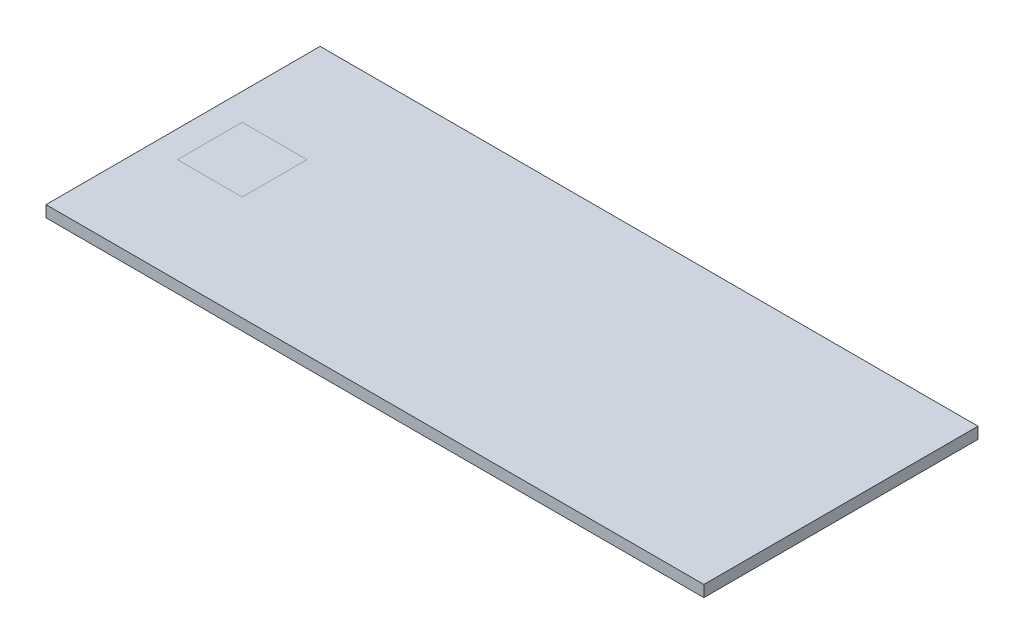
ISO-10303-21;
HEADER;
FILE_DESCRIPTION(('STEP AP214'),'2;1');
FILE_NAME('part.step','',(''),(''),'','','');
FILE_SCHEMA(('AUTOMOTIVE_DESIGN { 1 0 10303 214 1 1 1 1 }'));
ENDSEC;
DATA;
#1=APPLICATION_CONTEXT('core data for automotive mechanical design processes');
#2=APPLICATION_PROTOCOL_DEFINITION('international standard','automotive_design',2000,#1);
#3=PRODUCT_CONTEXT('',#1,'mechanical');
#4=PRODUCT('Part','Part','',(#3));
#5=PRODUCT_RELATED_PRODUCT_CATEGORY('part','',(#4));
#6=PRODUCT_DEFINITION_FORMATION('','',#4);
#7=PRODUCT_DEFINITION_CONTEXT('part definition',#1,'design');
#8=PRODUCT_DEFINITION('design','',#6,#7);
#9=PRODUCT_DEFINITION_SHAPE('','',#8);
#10=(LENGTH_UNIT() NAMED_UNIT(*) SI_UNIT(.MILLI.,.METRE.));
#11=(NAMED_UNIT(*) PLANE_ANGLE_UNIT() SI_UNIT($,.RADIAN.));
#12=(NAMED_UNIT(*) SI_UNIT($,.STERADIAN.) SOLID_ANGLE_UNIT());
#13=UNCERTAINTY_MEASURE_WITH_UNIT(LENGTH_MEASURE(1.E-05),#10,'distance_accuracy_value','');
#14=(GEOMETRIC_REPRESENTATION_CONTEXT(3) GLOBAL_UNCERTAINTY_ASSIGNED_CONTEXT((#13)) GLOBAL_UNIT_ASSIGNED_CONTEXT((#10,
#11,#12)) REPRESENTATION_CONTEXT('',''));
#15=CARTESIAN_POINT('',(0.,0.,0.));
#16=DIRECTION('',(0.,0.,1.));
#17=DIRECTION('',(1.,0.,0.));
#18=AXIS2_PLACEMENT_3D('',#15,#16,#17);
#19=CARTESIAN_POINT('',(914.4,-2.66453525910038E-12,381.));
#20=DIRECTION('',(0.,-1.,0.));
#21=DIRECTION('',(0.,0.,-1.));
#22=AXIS2_PLACEMENT_3D('',#19,#20,#21);
#23=PLANE('',#22);
#24=DIRECTION('',(-1.,0.,0.));
#25=VECTOR('',#24,1.);
#26=CARTESIAN_POINT('',(914.4,0.,-381.));
#27=LINE('',#26,#25);
#28=CARTESIAN_POINT('',(914.4,0.,-381.));
#29=VERTEX_POINT('',#28);
#30=CARTESIAN_POINT('',(-914.4,0.,-381.));
#31=VERTEX_POINT('',#30);
#32=EDGE_CURVE('E184',#29,#31,#27,.T.);
#33=ORIENTED_EDGE('',*,*,#32,.T.);
#34=DIRECTION('',(0.,0.,1.));
#35=VECTOR('',#34,1.);
#36=CARTESIAN_POINT('',(-914.4,-2.66453525910038E-12,381.));
#37=LINE('',#36,#35);
#38=CARTESIAN_POINT('',(-914.4,-2.66453525910038E-12,381.));
#39=VERTEX_POINT('',#38);
#40=EDGE_CURVE('E311',#31,#39,#37,.T.);
#41=ORIENTED_EDGE('',*,*,#40,.T.);
#42=DIRECTION('',(-1.,0.,0.));
#43=VECTOR('',#42,1.);
#44=CARTESIAN_POINT('',(914.4,-2.66453525910038E-12,381.));
#45=LINE('',#44,#43);
#46=CARTESIAN_POINT('',(914.4,-2.66453525910038E-12,381.));
#47=VERTEX_POINT('',#46);
#48=EDGE_CURVE('E177',#47,#39,#45,.T.);
#49=ORIENTED_EDGE('',*,*,#48,.F.);
#50=DIRECTION('',(0.,0.,1.));
#51=VECTOR('',#50,1.);
#52=CARTESIAN_POINT('',(914.4,-2.66453525910038E-12,381.));
#53=LINE('',#52,#51);
#54=EDGE_CURVE('E305',#29,#47,#53,.T.);
#55=ORIENTED_EDGE('',*,*,#54,.F.);
#56=EDGE_LOOP('',(#33,#41,#49,#55));
#57=FACE_BOUND('',#56,.T.);
#58=DIRECTION('',(0.,0.,-1.));
#59=VECTOR('',#58,1.);
#60=CARTESIAN_POINT('',(-660.,-2.66453525910038E-12,381.));
#61=LINE('',#60,#59);
#62=CARTESIAN_POINT('',(-660.,-1.64697651842031E-12,90.));
#63=VERTEX_POINT('',#62);
#64=CARTESIAN_POINT('',(-660.,-1.01755874068006E-12,-90.));
#65=VERTEX_POINT('',#64);
#66=EDGE_CURVE('E12',#63,#65,#61,.T.);
#67=ORIENTED_EDGE('',*,*,#66,.F.);
#68=DIRECTION('',(1.,0.,0.));
#69=VECTOR('',#68,1.);
#70=CARTESIAN_POINT('',(914.4,-1.64697651842031E-12,90.));
#71=LINE('',#70,#69);
#72=CARTESIAN_POINT('',(-840.,-1.64697651842031E-12,90.));
#73=VERTEX_POINT('',#72);
#74=EDGE_CURVE('E200',#73,#63,#71,.T.);
#75=ORIENTED_EDGE('',*,*,#74,.F.);
#76=DIRECTION('',(0.,0.,1.));
#77=VECTOR('',#76,1.);
#78=CARTESIAN_POINT('',(-840.,-2.66453525910038E-12,381.));
#79=LINE('',#78,#77);
#80=CARTESIAN_POINT('',(-840.,-1.01755874068006E-12,-90.0000000000001));
#81=VERTEX_POINT('',#80);
#82=EDGE_CURVE('E204',#81,#73,#79,.T.);
#83=ORIENTED_EDGE('',*,*,#82,.F.);
#84=DIRECTION('',(-1.,0.,0.));
#85=VECTOR('',#84,1.);
#86=CARTESIAN_POINT('',(914.4,-1.01755874068006E-12,-90.));
#87=LINE('',#86,#85);
#88=EDGE_CURVE('E63',#65,#81,#87,.T.);
#89=ORIENTED_EDGE('',*,*,#88,.F.);
#90=EDGE_LOOP('',(#67,#75,#83,#89));
#91=FACE_BOUND('',#90,.T.);
#92=ADVANCED_FACE('F53',(#57,#91),#23,.F.);
#93=CARTESIAN_POINT('',(914.4,-4.57200000000266,376.428));
#94=DIRECTION('',(0.,0.,1.));
#95=DIRECTION('',(1.,0.,0.));
#96=AXIS2_PLACEMENT_3D('',#93,#94,#95);
#97=PLANE('',#96);
#98=DIRECTION('',(0.,1.,0.));
#99=VECTOR('',#98,1.);
#100=CARTESIAN_POINT('',(909.828,-4.5720000000027,376.428));
#101=LINE('',#100,#99);
#102=CARTESIAN_POINT('',(909.828,-27.1779999999964,376.428));
#103=VERTEX_POINT('',#102);
#104=CARTESIAN_POINT('',(909.828,-4.57200000000266,376.428));
#105=VERTEX_POINT('',#104);
#106=EDGE_CURVE('E274',#103,#105,#101,.T.);
#107=ORIENTED_EDGE('',*,*,#106,.F.);
#108=DIRECTION('',(-1.,0.,0.));
#109=VECTOR('',#108,1.);
#110=CARTESIAN_POINT('',(914.4,-27.1780000000027,376.428));
#111=LINE('',#110,#109);
#112=CARTESIAN_POINT('',(-909.828,-27.1780000000027,376.428));
#113=VERTEX_POINT('',#112);
#114=EDGE_CURVE('E179',#103,#113,#111,.T.);
#115=ORIENTED_EDGE('',*,*,#114,.T.);
#116=DIRECTION('',(0.,-1.,0.));
#117=VECTOR('',#116,1.);
#118=CARTESIAN_POINT('',(-909.828,-4.57200000000266,376.428));
#119=LINE('',#118,#117);
#120=CARTESIAN_POINT('',(-909.828,-4.57200000000266,376.428));
#121=VERTEX_POINT('',#120);
#122=EDGE_CURVE('E280',#121,#113,#119,.T.);
#123=ORIENTED_EDGE('',*,*,#122,.F.);
#124=DIRECTION('',(-1.,0.,0.));
#125=VECTOR('',#124,1.);
#126=CARTESIAN_POINT('',(914.4,-4.57200000000266,376.428));
#127=LINE('',#126,#125);
#128=EDGE_CURVE('E196',#105,#121,#127,.T.);
#129=ORIENTED_EDGE('',*,*,#128,.F.);
#130=EDGE_LOOP('',(#107,#115,#123,#129));
#131=FACE_BOUND('',#130,.T.);
#132=ADVANCED_FACE('F55',(#131),#97,.F.);
#133=CARTESIAN_POINT('',(914.4,-4.57200000000266,376.428));
#134=DIRECTION('',(0.,1.,0.));
#135=DIRECTION('',(0.,0.,1.));
#136=AXIS2_PLACEMENT_3D('',#133,#134,#135);
#137=PLANE('',#136);
#138=DIRECTION('',(0.,0.,-1.));
#139=VECTOR('',#138,1.);
#140=CARTESIAN_POINT('',(909.828,-4.57200000000266,376.428));
#141=LINE('',#140,#139);
#142=CARTESIAN_POINT('',(909.828,-4.57200000000266,-376.428));
#143=VERTEX_POINT('',#142);
#144=EDGE_CURVE('E267',#105,#143,#141,.T.);
#145=ORIENTED_EDGE('',*,*,#144,.F.);
#146=ORIENTED_EDGE('',*,*,#128,.T.);
#147=DIRECTION('',(0.,0.,1.));
#148=VECTOR('',#147,1.);
#149=CARTESIAN_POINT('',(-909.828,-4.57200000000266,376.428));
#150=LINE('',#149,#148);
#151=CARTESIAN_POINT('',(-909.828,-4.57200000000266,-376.428));
#152=VERTEX_POINT('',#151);
#153=EDGE_CURVE('E285',#152,#121,#150,.T.);
#154=ORIENTED_EDGE('',*,*,#153,.F.);
#155=DIRECTION('',(-1.,0.,0.));
#156=VECTOR('',#155,1.);
#157=CARTESIAN_POINT('',(914.4,-4.57200000000266,-376.428));
#158=LINE('',#157,#156);
#159=EDGE_CURVE('E194',#143,#152,#158,.T.);
#160=ORIENTED_EDGE('',*,*,#159,.F.);
#161=EDGE_LOOP('',(#145,#146,#154,#160));
#162=FACE_BOUND('',#161,.T.);
#163=ADVANCED_FACE('F234',(#162),#137,.F.);
#164=CARTESIAN_POINT('',(914.4,-4.57200000000266,-376.428));
#165=DIRECTION('',(0.,0.,-1.));
#166=DIRECTION('',(-1.,0.,0.));
#167=AXIS2_PLACEMENT_3D('',#164,#165,#166);
#168=PLANE('',#167);
#169=DIRECTION('',(0.,-1.,0.));
#170=VECTOR('',#169,1.);
#171=CARTESIAN_POINT('',(909.828,-4.5720000000027,-376.428));
#172=LINE('',#171,#170);
#173=CARTESIAN_POINT('',(909.828,-27.1779999999964,-376.428));
#174=VERTEX_POINT('',#173);
#175=EDGE_CURVE('E275',#143,#174,#172,.T.);
#176=ORIENTED_EDGE('',*,*,#175,.F.);
#177=ORIENTED_EDGE('',*,*,#159,.T.);
#178=DIRECTION('',(0.,1.,0.));
#179=VECTOR('',#178,1.);
#180=CARTESIAN_POINT('',(-909.828,-4.57200000000266,-376.428));
#181=LINE('',#180,#179);
#182=CARTESIAN_POINT('',(-909.828,-27.178,-376.428));
#183=VERTEX_POINT('',#182);
#184=EDGE_CURVE('E290',#183,#152,#181,.T.);
#185=ORIENTED_EDGE('',*,*,#184,.F.);
#186=DIRECTION('',(-1.,0.,0.));
#187=VECTOR('',#186,1.);
#188=CARTESIAN_POINT('',(914.4,-27.178,-376.428));
#189=LINE('',#188,#187);
#190=EDGE_CURVE('E192',#174,#183,#189,.T.);
#191=ORIENTED_EDGE('',*,*,#190,.F.);
#192=EDGE_LOOP('',(#176,#177,#185,#191));
#193=FACE_BOUND('',#192,.T.);
#194=ADVANCED_FACE('F257',(#193),#168,.F.);
#195=CARTESIAN_POINT('',(914.4,-27.178,-349.25));
#196=DIRECTION('',(0.,0.,-1.));
#197=DIRECTION('',(-1.,0.,0.));
#198=AXIS2_PLACEMENT_3D('',#195,#196,#197);
#199=PLANE('',#198);
#200=DIRECTION('',(0.,-1.,0.));
#201=VECTOR('',#200,1.);
#202=CARTESIAN_POINT('',(882.65,-27.178,-349.25));
#203=LINE('',#202,#201);
#204=CARTESIAN_POINT('',(882.65,-27.1779999999966,-349.25));
#205=VERTEX_POINT('',#204);
#206=CARTESIAN_POINT('',(882.65,-31.7499999999967,-349.25));
#207=VERTEX_POINT('',#206);
#208=EDGE_CURVE('E156',#205,#207,#203,.T.);
#209=ORIENTED_EDGE('',*,*,#208,.F.);
#210=DIRECTION('',(-1.,0.,0.));
#211=VECTOR('',#210,1.);
#212=CARTESIAN_POINT('',(914.4,-27.178,-349.25));
#213=LINE('',#212,#211);
#214=CARTESIAN_POINT('',(-882.65,-27.178,-349.25));
#215=VERTEX_POINT('',#214);
#216=EDGE_CURVE('E190',#205,#215,#213,.T.);
#217=ORIENTED_EDGE('',*,*,#216,.T.);
#218=DIRECTION('',(0.,1.,0.));
#219=VECTOR('',#218,1.);
#220=CARTESIAN_POINT('',(-882.65,-27.178,-349.25));
#221=LINE('',#220,#219);
#222=CARTESIAN_POINT('',(-882.65,-31.75,-349.25));
#223=VERTEX_POINT('',#222);
#224=EDGE_CURVE('E296',#223,#215,#221,.T.);
#225=ORIENTED_EDGE('',*,*,#224,.F.);
#226=DIRECTION('',(-1.,0.,0.));
#227=VECTOR('',#226,1.);
#228=CARTESIAN_POINT('',(914.4,-31.75,-349.25));
#229=LINE('',#228,#227);
#230=EDGE_CURVE('E188',#207,#223,#229,.T.);
#231=ORIENTED_EDGE('',*,*,#230,.F.);
#232=EDGE_LOOP('',(#209,#217,#225,#231));
#233=FACE_BOUND('',#232,.T.);
#234=ADVANCED_FACE('F254',(#233),#199,.F.);
#235=CARTESIAN_POINT('',(914.4,-27.1780000000027,349.25));
#236=DIRECTION('',(0.,0.,1.));
#237=DIRECTION('',(1.,0.,0.));
#238=AXIS2_PLACEMENT_3D('',#235,#236,#237);
#239=PLANE('',#238);
#240=DIRECTION('',(0.,1.,0.));
#241=VECTOR('',#240,1.);
#242=CARTESIAN_POINT('',(882.65,-27.1780000000027,349.25));
#243=LINE('',#242,#241);
#244=CARTESIAN_POINT('',(882.65,-31.7499999999967,349.25));
#245=VERTEX_POINT('',#244);
#246=CARTESIAN_POINT('',(882.65,-27.1779999999966,349.25));
#247=VERTEX_POINT('',#246);
#248=EDGE_CURVE('E153',#245,#247,#243,.T.);
#249=ORIENTED_EDGE('',*,*,#248,.F.);
#250=DIRECTION('',(-1.,0.,0.));
#251=VECTOR('',#250,1.);
#252=CARTESIAN_POINT('',(914.4,-31.7500000000022,349.25));
#253=LINE('',#252,#251);
#254=CARTESIAN_POINT('',(-882.65,-31.7500000000022,349.25));
#255=VERTEX_POINT('',#254);
#256=EDGE_CURVE('E166',#245,#255,#253,.T.);
#257=ORIENTED_EDGE('',*,*,#256,.T.);
#258=DIRECTION('',(0.,-1.,0.));
#259=VECTOR('',#258,1.);
#260=CARTESIAN_POINT('',(-882.65,-27.1780000000027,349.25));
#261=LINE('',#260,#259);
#262=CARTESIAN_POINT('',(-882.65,-27.1780000000027,349.25));
#263=VERTEX_POINT('',#262);
#264=EDGE_CURVE('E284',#263,#255,#261,.T.);
#265=ORIENTED_EDGE('',*,*,#264,.F.);
#266=DIRECTION('',(-1.,0.,0.));
#267=VECTOR('',#266,1.);
#268=CARTESIAN_POINT('',(914.4,-27.1780000000027,349.25));
#269=LINE('',#268,#267);
#270=EDGE_CURVE('E168',#247,#263,#269,.T.);
#271=ORIENTED_EDGE('',*,*,#270,.F.);
#272=EDGE_LOOP('',(#249,#257,#265,#271));
#273=FACE_BOUND('',#272,.T.);
#274=ADVANCED_FACE('F164',(#273),#239,.F.);
#275=CARTESIAN_POINT('',(914.4,-27.1780000000027,376.428));
#276=DIRECTION('',(0.,-1.,0.));
#277=DIRECTION('',(0.,0.,-1.));
#278=AXIS2_PLACEMENT_3D('',#275,#276,#277);
#279=PLANE('',#278);
#280=ORIENTED_EDGE('',*,*,#216,.F.);
#281=DIRECTION('',(0.,0.,-1.));
#282=VECTOR('',#281,1.);
#283=CARTESIAN_POINT('',(882.65,-27.1779999999966,381.));
#284=LINE('',#283,#282);
#285=EDGE_CURVE('E160',#247,#205,#284,.T.);
#286=ORIENTED_EDGE('',*,*,#285,.F.);
#287=ORIENTED_EDGE('',*,*,#270,.T.);
#288=DIRECTION('',(0.,0.,-1.));
#289=VECTOR('',#288,1.);
#290=CARTESIAN_POINT('',(-882.65,-27.1780000000026,381.));
#291=LINE('',#290,#289);
#292=EDGE_CURVE('E483',#263,#215,#291,.T.);
#293=ORIENTED_EDGE('',*,*,#292,.T.);
#294=EDGE_LOOP('',(#280,#286,#287,#293));
#295=FACE_BOUND('',#294,.T.);
#296=DIRECTION('',(0.,0.,-1.));
#297=VECTOR('',#296,1.);
#298=CARTESIAN_POINT('',(909.828,-27.1779999999964,381.));
#299=LINE('',#298,#297);
#300=EDGE_CURVE('E474',#103,#174,#299,.T.);
#301=ORIENTED_EDGE('',*,*,#300,.T.);
#302=ORIENTED_EDGE('',*,*,#190,.T.);
#303=DIRECTION('',(0.,0.,-1.));
#304=VECTOR('',#303,1.);
#305=CARTESIAN_POINT('',(-909.828,-27.1780000000027,376.428));
#306=LINE('',#305,#304);
#307=EDGE_CURVE('E198',#113,#183,#306,.T.);
#308=ORIENTED_EDGE('',*,*,#307,.F.);
#309=ORIENTED_EDGE('',*,*,#114,.F.);
#310=EDGE_LOOP('',(#301,#302,#308,#309));
#311=FACE_BOUND('',#310,.T.);
#312=ADVANCED_FACE('F245',(#295,#311),#279,.F.);
#313=CARTESIAN_POINT('',(914.4,0.,-381.));
#314=DIRECTION('',(0.,0.,1.));
#315=DIRECTION('',(0.,-1.,0.));
#316=AXIS2_PLACEMENT_3D('',#313,#314,#315);
#317=PLANE('',#316);
#318=DIRECTION('',(0.,1.,0.));
#319=VECTOR('',#318,1.);
#320=CARTESIAN_POINT('',(-914.4,0.,-381.));
#321=LINE('',#320,#319);
#322=CARTESIAN_POINT('',(-914.4,-31.75,-381.));
#323=VERTEX_POINT('',#322);
#324=EDGE_CURVE('E299',#323,#31,#321,.T.);
#325=ORIENTED_EDGE('',*,*,#324,.T.);
#326=ORIENTED_EDGE('',*,*,#32,.F.);
#327=DIRECTION('',(0.,1.,0.));
#328=VECTOR('',#327,1.);
#329=CARTESIAN_POINT('',(914.4,0.,-381.));
#330=LINE('',#329,#328);
#331=CARTESIAN_POINT('',(914.4,-31.75,-381.));
#332=VERTEX_POINT('',#331);
#333=EDGE_CURVE('E302',#332,#29,#330,.T.);
#334=ORIENTED_EDGE('',*,*,#333,.F.);
#335=DIRECTION('',(-1.,0.,0.));
#336=VECTOR('',#335,1.);
#337=CARTESIAN_POINT('',(914.4,-31.75,-381.));
#338=LINE('',#337,#336);
#339=EDGE_CURVE('E186',#332,#323,#338,.T.);
#340=ORIENTED_EDGE('',*,*,#339,.T.);
#341=EDGE_LOOP('',(#325,#326,#334,#340));
#342=FACE_BOUND('',#341,.T.);
#343=ADVANCED_FACE('F240',(#342),#317,.F.);
#344=ORIENTED_EDGE('',*,*,#74,.T.);
#345=ORIENTED_EDGE('',*,*,#66,.T.);
#346=ORIENTED_EDGE('',*,*,#88,.T.);
#347=ORIENTED_EDGE('',*,*,#82,.T.);
#348=EDGE_LOOP('',(#344,#345,#346,#347));
#349=FACE_BOUND('',#348,.T.);
#350=ADVANCED_FACE('F224',(#349),#23,.F.);
#351=CARTESIAN_POINT('',(914.4,-2.66453525910038E-12,381.));
#352=DIRECTION('',(0.,0.,-1.));
#353=DIRECTION('',(0.,1.,0.));
#354=AXIS2_PLACEMENT_3D('',#351,#352,#353);
#355=PLANE('',#354);
#356=ORIENTED_EDGE('',*,*,#48,.T.);
#357=DIRECTION('',(0.,-1.,0.));
#358=VECTOR('',#357,1.);
#359=CARTESIAN_POINT('',(-914.4,-2.66453525910038E-12,381.));
#360=LINE('',#359,#358);
#361=CARTESIAN_POINT('',(-914.4,-31.7500000000027,381.));
#362=VERTEX_POINT('',#361);
#363=EDGE_CURVE('E314',#39,#362,#360,.T.);
#364=ORIENTED_EDGE('',*,*,#363,.T.);
#365=DIRECTION('',(-1.,0.,0.));
#366=VECTOR('',#365,1.);
#367=CARTESIAN_POINT('',(914.4,-31.7500000000027,381.));
#368=LINE('',#367,#366);
#369=CARTESIAN_POINT('',(914.4,-31.7500000000027,381.));
#370=VERTEX_POINT('',#369);
#371=EDGE_CURVE('E175',#370,#362,#368,.T.);
#372=ORIENTED_EDGE('',*,*,#371,.F.);
#373=DIRECTION('',(0.,-1.,0.));
#374=VECTOR('',#373,1.);
#375=CARTESIAN_POINT('',(914.4,-2.66453525910038E-12,381.));
#376=LINE('',#375,#374);
#377=EDGE_CURVE('E307',#47,#370,#376,.T.);
#378=ORIENTED_EDGE('',*,*,#377,.F.);
#379=EDGE_LOOP('',(#356,#364,#372,#378));
#380=FACE_BOUND('',#379,.T.);
#381=ADVANCED_FACE('F239',(#380),#355,.F.);
#382=CARTESIAN_POINT('',(914.4,-31.7500000000027,381.));
#383=DIRECTION('',(0.,1.,0.));
#384=DIRECTION('',(0.,0.,1.));
#385=AXIS2_PLACEMENT_3D('',#382,#383,#384);
#386=PLANE('',#385);
#387=DIRECTION('',(0.,0.,-1.));
#388=VECTOR('',#387,1.);
#389=CARTESIAN_POINT('',(882.65,-31.7499999999967,381.));
#390=LINE('',#389,#388);
#391=EDGE_CURVE('E150',#245,#207,#390,.T.);
#392=ORIENTED_EDGE('',*,*,#391,.T.);
#393=ORIENTED_EDGE('',*,*,#230,.T.);
#394=DIRECTION('',(0.,0.,-1.));
#395=VECTOR('',#394,1.);
#396=CARTESIAN_POINT('',(-882.65,-31.7500000000027,381.));
#397=LINE('',#396,#395);
#398=EDGE_CURVE('E174',#255,#223,#397,.T.);
#399=ORIENTED_EDGE('',*,*,#398,.F.);
#400=ORIENTED_EDGE('',*,*,#256,.F.);
#401=EDGE_LOOP('',(#392,#393,#399,#400));
#402=FACE_BOUND('',#401,.T.);
#403=DIRECTION('',(0.,0.,-1.));
#404=VECTOR('',#403,1.);
#405=CARTESIAN_POINT('',(914.4,-31.75,-381.));
#406=LINE('',#405,#404);
#407=EDGE_CURVE('E300',#370,#332,#406,.T.);
#408=ORIENTED_EDGE('',*,*,#407,.F.);
#409=ORIENTED_EDGE('',*,*,#371,.T.);
#410=DIRECTION('',(0.,0.,-1.));
#411=VECTOR('',#410,1.);
#412=CARTESIAN_POINT('',(-914.4,-31.7500000000027,381.));
#413=LINE('',#412,#411);
#414=EDGE_CURVE('E303',#362,#323,#413,.T.);
#415=ORIENTED_EDGE('',*,*,#414,.T.);
#416=ORIENTED_EDGE('',*,*,#339,.F.);
#417=EDGE_LOOP('',(#408,#409,#415,#416));
#418=FACE_BOUND('',#417,.T.);
#419=ADVANCED_FACE('F171',(#402,#418),#386,.F.);
#420=CARTESIAN_POINT('',(914.4,0.,0.));
#421=DIRECTION('',(1.,0.,0.));
#422=DIRECTION('',(0.,0.,-1.));
#423=AXIS2_PLACEMENT_3D('',#420,#421,#422);
#424=PLANE('',#423);
#425=ORIENTED_EDGE('',*,*,#377,.T.);
#426=ORIENTED_EDGE('',*,*,#407,.T.);
#427=ORIENTED_EDGE('',*,*,#333,.T.);
#428=ORIENTED_EDGE('',*,*,#54,.T.);
#429=EDGE_LOOP('',(#425,#426,#427,#428));
#430=FACE_BOUND('',#429,.T.);
#431=ADVANCED_FACE('F330',(#430),#424,.T.);
#432=CARTESIAN_POINT('',(-914.4,0.,0.));
#433=DIRECTION('',(1.,0.,0.));
#434=DIRECTION('',(0.,0.,-1.));
#435=AXIS2_PLACEMENT_3D('',#432,#433,#434);
#436=PLANE('',#435);
#437=ORIENTED_EDGE('',*,*,#324,.F.);
#438=ORIENTED_EDGE('',*,*,#414,.F.);
#439=ORIENTED_EDGE('',*,*,#363,.F.);
#440=ORIENTED_EDGE('',*,*,#40,.F.);
#441=EDGE_LOOP('',(#437,#438,#439,#440));
#442=FACE_BOUND('',#441,.T.);
#443=ADVANCED_FACE('F326',(#442),#436,.F.);
#444=CARTESIAN_POINT('',(-882.65,-31.7500000000027,381.));
#445=DIRECTION('',(-1.,0.,0.));
#446=DIRECTION('',(0.,0.,1.));
#447=AXIS2_PLACEMENT_3D('',#444,#445,#446);
#448=PLANE('',#447);
#449=ORIENTED_EDGE('',*,*,#398,.T.);
#450=ORIENTED_EDGE('',*,*,#224,.T.);
#451=ORIENTED_EDGE('',*,*,#292,.F.);
#452=ORIENTED_EDGE('',*,*,#264,.T.);
#453=EDGE_LOOP('',(#449,#450,#451,#452));
#454=FACE_BOUND('',#453,.T.);
#455=ADVANCED_FACE('F339',(#454),#448,.F.);
#456=CARTESIAN_POINT('',(-909.828,-27.1780000000026,381.));
#457=DIRECTION('',(-1.,0.,0.));
#458=DIRECTION('',(0.,0.,1.));
#459=AXIS2_PLACEMENT_3D('',#456,#457,#458);
#460=PLANE('',#459);
#461=ORIENTED_EDGE('',*,*,#153,.T.);
#462=ORIENTED_EDGE('',*,*,#122,.T.);
#463=ORIENTED_EDGE('',*,*,#307,.T.);
#464=ORIENTED_EDGE('',*,*,#184,.T.);
#465=EDGE_LOOP('',(#461,#462,#463,#464));
#466=FACE_BOUND('',#465,.T.);
#467=ADVANCED_FACE('F288',(#466),#460,.F.);
#468=CARTESIAN_POINT('',(909.828,-27.1779999999964,381.));
#469=DIRECTION('',(1.,0.,0.));
#470=DIRECTION('',(0.,1.,0.));
#471=AXIS2_PLACEMENT_3D('',#468,#469,#470);
#472=PLANE('',#471);
#473=ORIENTED_EDGE('',*,*,#300,.F.);
#474=ORIENTED_EDGE('',*,*,#106,.T.);
#475=ORIENTED_EDGE('',*,*,#144,.T.);
#476=ORIENTED_EDGE('',*,*,#175,.T.);
#477=EDGE_LOOP('',(#473,#474,#475,#476));
#478=FACE_BOUND('',#477,.T.);
#479=ADVANCED_FACE('F403',(#478),#472,.F.);
#480=CARTESIAN_POINT('',(882.65,-31.7499999999967,381.));
#481=DIRECTION('',(1.,0.,0.));
#482=DIRECTION('',(0.,0.,-1.));
#483=AXIS2_PLACEMENT_3D('',#480,#481,#482);
#484=PLANE('',#483);
#485=ORIENTED_EDGE('',*,*,#285,.T.);
#486=ORIENTED_EDGE('',*,*,#208,.T.);
#487=ORIENTED_EDGE('',*,*,#391,.F.);
#488=ORIENTED_EDGE('',*,*,#248,.T.);
#489=EDGE_LOOP('',(#485,#486,#487,#488));
#490=FACE_BOUND('',#489,.T.);
#491=ADVANCED_FACE('F152',(#490),#484,.F.);
#492=CLOSED_SHELL('',(#92,#132,#163,#194,#234,#274,#312,#343,#350,#381,#419,#431,#443,#455,#467,
#479,#491));
#493=MANIFOLD_SOLID_BREP('B2',#492);
#494=ADVANCED_BREP_SHAPE_REPRESENTATION('',(#18,#493),#14);
#495=SHAPE_DEFINITION_REPRESENTATION(#9,#494);
ENDSEC;
END-ISO-10303-21;
